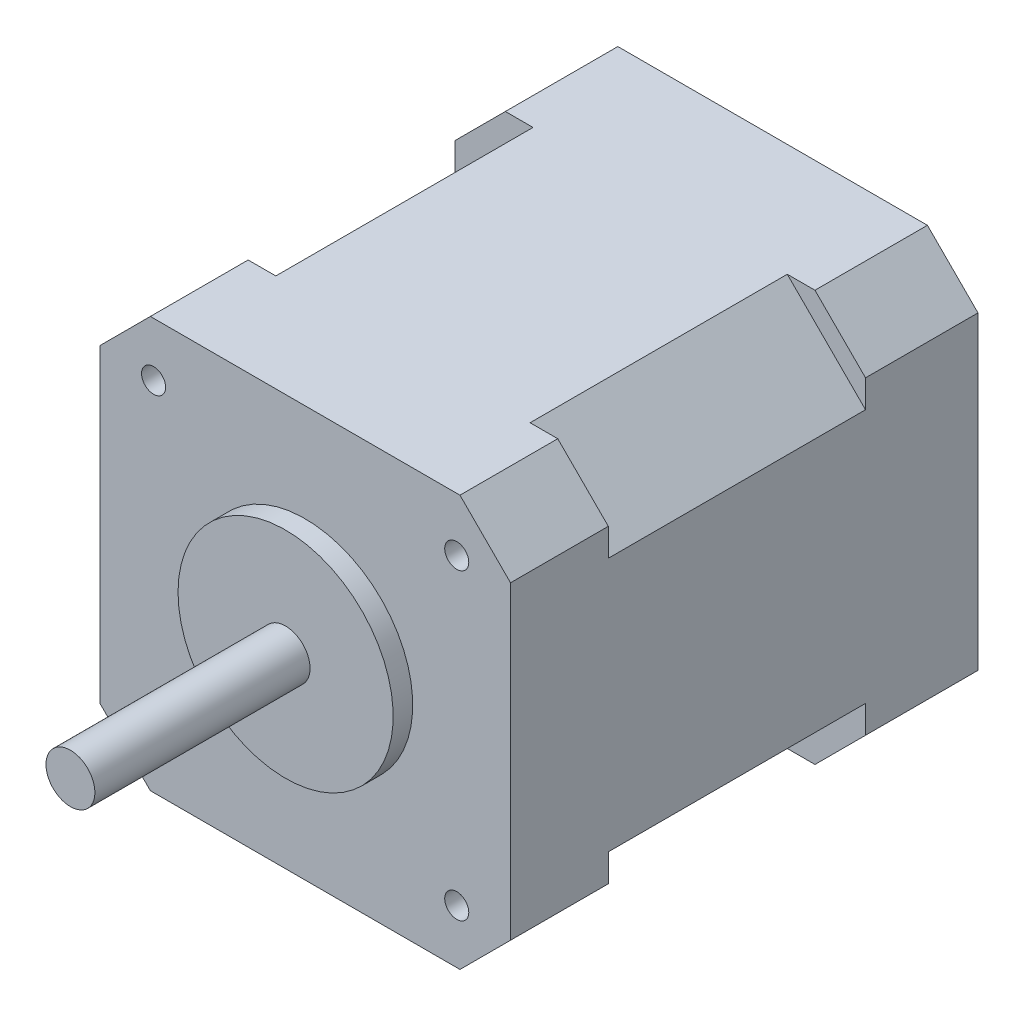
ISO-10303-21;
HEADER;
FILE_DESCRIPTION(('STEP AP214'),'2;1');
FILE_NAME('part.step','',(''),(''),'','','');
FILE_SCHEMA(('AUTOMOTIVE_DESIGN { 1 0 10303 214 1 1 1 1 }'));
ENDSEC;
DATA;
#1=APPLICATION_CONTEXT('core data for automotive mechanical design processes');
#2=APPLICATION_PROTOCOL_DEFINITION('international standard','automotive_design',2000,#1);
#3=PRODUCT_CONTEXT('',#1,'mechanical');
#4=PRODUCT('Part','Part','',(#3));
#5=PRODUCT_RELATED_PRODUCT_CATEGORY('part','',(#4));
#6=PRODUCT_DEFINITION_FORMATION('','',#4);
#7=PRODUCT_DEFINITION_CONTEXT('part definition',#1,'design');
#8=PRODUCT_DEFINITION('design','',#6,#7);
#9=PRODUCT_DEFINITION_SHAPE('','',#8);
#10=(LENGTH_UNIT() NAMED_UNIT(*) SI_UNIT(.MILLI.,.METRE.));
#11=(NAMED_UNIT(*) PLANE_ANGLE_UNIT() SI_UNIT($,.RADIAN.));
#12=(NAMED_UNIT(*) SI_UNIT($,.STERADIAN.) SOLID_ANGLE_UNIT());
#13=UNCERTAINTY_MEASURE_WITH_UNIT(LENGTH_MEASURE(1.E-05),#10,'distance_accuracy_value','');
#14=(GEOMETRIC_REPRESENTATION_CONTEXT(3) GLOBAL_UNCERTAINTY_ASSIGNED_CONTEXT((#13)) GLOBAL_UNIT_ASSIGNED_CONTEXT((#10,
#11,#12)) REPRESENTATION_CONTEXT('',''));
#15=CARTESIAN_POINT('',(0.,0.,0.));
#16=DIRECTION('',(0.,0.,1.));
#17=DIRECTION('',(1.,0.,0.));
#18=AXIS2_PLACEMENT_3D('',#15,#16,#17);
#19=CARTESIAN_POINT('',(21.,21.,11.5));
#20=DIRECTION('',(0.,0.,-1.));
#21=DIRECTION('',(-1.,0.,0.));
#22=AXIS2_PLACEMENT_3D('',#19,#20,#21);
#23=PLANE('',#22);
#24=DIRECTION('',(0.707106781186548,0.707106781186547,0.));
#25=VECTOR('',#24,1.);
#26=CARTESIAN_POINT('',(21.,-13.,11.5));
#27=LINE('',#26,#25);
#28=CARTESIAN_POINT('',(13.,-21.,11.5));
#29=VERTEX_POINT('',#28);
#30=CARTESIAN_POINT('',(21.,-13.,11.5));
#31=VERTEX_POINT('',#30);
#32=EDGE_CURVE('E219',#29,#31,#27,.T.);
#33=ORIENTED_EDGE('',*,*,#32,.F.);
#34=DIRECTION('',(-1.,0.,0.));
#35=VECTOR('',#34,1.);
#36=CARTESIAN_POINT('',(15.8284271247401,-21.,11.5));
#37=LINE('',#36,#35);
#38=CARTESIAN_POINT('',(15.8284271247401,-21.,11.5));
#39=VERTEX_POINT('',#38);
#40=EDGE_CURVE('E489',#39,#29,#37,.T.);
#41=ORIENTED_EDGE('',*,*,#40,.F.);
#42=DIRECTION('',(-0.707106781186547,-0.707106781186547,0.));
#43=VECTOR('',#42,1.);
#44=CARTESIAN_POINT('',(21.,-15.8284271247401,11.5));
#45=LINE('',#44,#43);
#46=CARTESIAN_POINT('',(21.,-15.8284271247401,11.5));
#47=VERTEX_POINT('',#46);
#48=EDGE_CURVE('E476',#47,#39,#45,.T.);
#49=ORIENTED_EDGE('',*,*,#48,.F.);
#50=DIRECTION('',(0.,-1.,0.));
#51=VECTOR('',#50,1.);
#52=CARTESIAN_POINT('',(21.,15.8284271247401,11.5));
#53=LINE('',#52,#51);
#54=EDGE_CURVE('E47',#31,#47,#53,.T.);
#55=ORIENTED_EDGE('',*,*,#54,.F.);
#56=EDGE_LOOP('',(#33,#41,#49,#55));
#57=FACE_BOUND('',#56,.T.);
#58=ADVANCED_FACE('F32',(#57),#23,.F.);
#59=DIRECTION('',(0.707106781186547,-0.707106781186548,0.));
#60=VECTOR('',#59,1.);
#61=CARTESIAN_POINT('',(-13.,-21.,11.5));
#62=LINE('',#61,#60);
#63=CARTESIAN_POINT('',(-21.,-13.,11.5));
#64=VERTEX_POINT('',#63);
#65=CARTESIAN_POINT('',(-13.,-21.,11.5));
#66=VERTEX_POINT('',#65);
#67=EDGE_CURVE('E343',#64,#66,#62,.T.);
#68=ORIENTED_EDGE('',*,*,#67,.F.);
#69=DIRECTION('',(0.,1.,0.));
#70=VECTOR('',#69,1.);
#71=CARTESIAN_POINT('',(-21.,-15.8284271247401,11.5));
#72=LINE('',#71,#70);
#73=CARTESIAN_POINT('',(-21.,-15.8284271247401,11.5));
#74=VERTEX_POINT('',#73);
#75=EDGE_CURVE('E403',#74,#64,#72,.T.);
#76=ORIENTED_EDGE('',*,*,#75,.F.);
#77=DIRECTION('',(-0.707106781186547,0.707106781186548,0.));
#78=VECTOR('',#77,1.);
#79=CARTESIAN_POINT('',(-15.8284271247401,-21.,11.5));
#80=LINE('',#79,#78);
#81=CARTESIAN_POINT('',(-15.8284271247401,-21.,11.5));
#82=VERTEX_POINT('',#81);
#83=EDGE_CURVE('E414',#82,#74,#80,.T.);
#84=ORIENTED_EDGE('',*,*,#83,.F.);
#85=EDGE_CURVE('E479',#66,#82,#37,.T.);
#86=ORIENTED_EDGE('',*,*,#85,.F.);
#87=EDGE_LOOP('',(#68,#76,#84,#86));
#88=FACE_BOUND('',#87,.T.);
#89=ADVANCED_FACE('F496',(#88),#23,.F.);
#90=DIRECTION('',(-0.707106781186548,-0.707106781186548,0.));
#91=VECTOR('',#90,1.);
#92=CARTESIAN_POINT('',(-21.,13.,11.5));
#93=LINE('',#92,#91);
#94=CARTESIAN_POINT('',(-13.,21.,11.5));
#95=VERTEX_POINT('',#94);
#96=CARTESIAN_POINT('',(-21.,13.,11.5));
#97=VERTEX_POINT('',#96);
#98=EDGE_CURVE('E348',#95,#97,#93,.T.);
#99=ORIENTED_EDGE('',*,*,#98,.F.);
#100=DIRECTION('',(1.,0.,0.));
#101=VECTOR('',#100,1.);
#102=CARTESIAN_POINT('',(-15.8284271247401,21.,11.5));
#103=LINE('',#102,#101);
#104=CARTESIAN_POINT('',(-15.8284271247401,21.,11.5));
#105=VERTEX_POINT('',#104);
#106=EDGE_CURVE('E464',#105,#95,#103,.T.);
#107=ORIENTED_EDGE('',*,*,#106,.F.);
#108=DIRECTION('',(0.707106781186547,0.707106781186548,0.));
#109=VECTOR('',#108,1.);
#110=CARTESIAN_POINT('',(-21.,15.8284271247401,11.5));
#111=LINE('',#110,#109);
#112=CARTESIAN_POINT('',(-21.,15.8284271247401,11.5));
#113=VERTEX_POINT('',#112);
#114=EDGE_CURVE('E408',#113,#105,#111,.T.);
#115=ORIENTED_EDGE('',*,*,#114,.F.);
#116=EDGE_CURVE('E409',#97,#113,#72,.T.);
#117=ORIENTED_EDGE('',*,*,#116,.F.);
#118=EDGE_LOOP('',(#99,#107,#115,#117));
#119=FACE_BOUND('',#118,.T.);
#120=ADVANCED_FACE('F498',(#119),#23,.F.);
#121=DIRECTION('',(-0.707106781186548,0.707106781186547,0.));
#122=VECTOR('',#121,1.);
#123=CARTESIAN_POINT('',(13.,21.,11.5));
#124=LINE('',#123,#122);
#125=CARTESIAN_POINT('',(21.,13.,11.5));
#126=VERTEX_POINT('',#125);
#127=CARTESIAN_POINT('',(13.,21.,11.5));
#128=VERTEX_POINT('',#127);
#129=EDGE_CURVE('E55',#126,#128,#124,.T.);
#130=ORIENTED_EDGE('',*,*,#129,.F.);
#131=CARTESIAN_POINT('',(21.,15.8284271247401,11.5));
#132=VERTEX_POINT('',#131);
#133=EDGE_CURVE('E475',#132,#126,#53,.T.);
#134=ORIENTED_EDGE('',*,*,#133,.F.);
#135=DIRECTION('',(0.707106781186547,-0.707106781186548,0.));
#136=VECTOR('',#135,1.);
#137=CARTESIAN_POINT('',(15.8284271247401,21.,11.5));
#138=LINE('',#137,#136);
#139=CARTESIAN_POINT('',(15.8284271247401,21.,11.5));
#140=VERTEX_POINT('',#139);
#141=EDGE_CURVE('E466',#140,#132,#138,.T.);
#142=ORIENTED_EDGE('',*,*,#141,.F.);
#143=EDGE_CURVE('E418',#128,#140,#103,.T.);
#144=ORIENTED_EDGE('',*,*,#143,.F.);
#145=EDGE_LOOP('',(#130,#134,#142,#144));
#146=FACE_BOUND('',#145,.T.);
#147=ADVANCED_FACE('F474',(#146),#23,.F.);
#148=CARTESIAN_POINT('',(-15.8284271247401,21.,11.5));
#149=DIRECTION('',(0.,1.,0.));
#150=DIRECTION('',(0.,0.,1.));
#151=AXIS2_PLACEMENT_3D('',#148,#149,#150);
#152=PLANE('',#151);
#153=DIRECTION('',(1.,0.,0.));
#154=VECTOR('',#153,1.);
#155=CARTESIAN_POINT('',(-15.8284271247401,21.,0.));
#156=LINE('',#155,#154);
#157=CARTESIAN_POINT('',(-15.8284271247401,21.,0.));
#158=VERTEX_POINT('',#157);
#159=CARTESIAN_POINT('',(15.8284271247401,21.,0.));
#160=VERTEX_POINT('',#159);
#161=EDGE_CURVE('E426',#158,#160,#156,.T.);
#162=ORIENTED_EDGE('',*,*,#161,.F.);
#163=DIRECTION('',(0.,0.,-1.));
#164=VECTOR('',#163,1.);
#165=CARTESIAN_POINT('',(-15.8284271247401,21.,11.5));
#166=LINE('',#165,#164);
#167=EDGE_CURVE('E451',#105,#158,#166,.T.);
#168=ORIENTED_EDGE('',*,*,#167,.F.);
#169=ORIENTED_EDGE('',*,*,#106,.T.);
#170=DIRECTION('',(0.,0.,-1.));
#171=VECTOR('',#170,1.);
#172=CARTESIAN_POINT('',(-13.,21.,37.8));
#173=LINE('',#172,#171);
#174=CARTESIAN_POINT('',(-13.,21.,37.8));
#175=VERTEX_POINT('',#174);
#176=EDGE_CURVE('E368',#175,#95,#173,.T.);
#177=ORIENTED_EDGE('',*,*,#176,.F.);
#178=DIRECTION('',(-1.,0.,0.));
#179=VECTOR('',#178,1.);
#180=CARTESIAN_POINT('',(-15.8284271247401,21.,37.8));
#181=LINE('',#180,#179);
#182=CARTESIAN_POINT('',(-15.8284271247401,21.,37.8));
#183=VERTEX_POINT('',#182);
#184=EDGE_CURVE('E217',#175,#183,#181,.T.);
#185=ORIENTED_EDGE('',*,*,#184,.T.);
#186=DIRECTION('',(0.,0.,-1.));
#187=VECTOR('',#186,1.);
#188=CARTESIAN_POINT('',(-15.8284271247401,21.,47.8));
#189=LINE('',#188,#187);
#190=CARTESIAN_POINT('',(-15.8284271247401,21.,47.8));
#191=VERTEX_POINT('',#190);
#192=EDGE_CURVE('E198',#191,#183,#189,.T.);
#193=ORIENTED_EDGE('',*,*,#192,.F.);
#194=DIRECTION('',(-1.,0.,0.));
#195=VECTOR('',#194,1.);
#196=CARTESIAN_POINT('',(-15.8284271247401,21.,47.8));
#197=LINE('',#196,#195);
#198=CARTESIAN_POINT('',(15.8284271247401,21.,47.8));
#199=VERTEX_POINT('',#198);
#200=EDGE_CURVE('E204',#199,#191,#197,.T.);
#201=ORIENTED_EDGE('',*,*,#200,.F.);
#202=DIRECTION('',(0.,0.,-1.));
#203=VECTOR('',#202,1.);
#204=CARTESIAN_POINT('',(15.8284271247401,21.,47.8));
#205=LINE('',#204,#203);
#206=CARTESIAN_POINT('',(15.8284271247401,21.,37.8));
#207=VERTEX_POINT('',#206);
#208=EDGE_CURVE('E286',#199,#207,#205,.T.);
#209=ORIENTED_EDGE('',*,*,#208,.T.);
#210=CARTESIAN_POINT('',(13.,21.,37.8));
#211=VERTEX_POINT('',#210);
#212=EDGE_CURVE('E227',#207,#211,#181,.T.);
#213=ORIENTED_EDGE('',*,*,#212,.T.);
#214=DIRECTION('',(0.,0.,-1.));
#215=VECTOR('',#214,1.);
#216=CARTESIAN_POINT('',(13.,21.,37.8));
#217=LINE('',#216,#215);
#218=EDGE_CURVE('E292',#211,#128,#217,.T.);
#219=ORIENTED_EDGE('',*,*,#218,.T.);
#220=ORIENTED_EDGE('',*,*,#143,.T.);
#221=DIRECTION('',(0.,0.,-1.));
#222=VECTOR('',#221,1.);
#223=CARTESIAN_POINT('',(15.8284271247401,21.,11.5));
#224=LINE('',#223,#222);
#225=EDGE_CURVE('E412',#140,#160,#224,.T.);
#226=ORIENTED_EDGE('',*,*,#225,.T.);
#227=EDGE_LOOP('',(#162,#168,#169,#177,#185,#193,#201,#209,#213,#219,#220,#226));
#228=FACE_BOUND('',#227,.T.);
#229=ADVANCED_FACE('F34',(#228),#152,.T.);
#230=CARTESIAN_POINT('',(-21.,15.8284271247401,11.5));
#231=DIRECTION('',(-0.707106781186548,0.707106781186547,0.));
#232=DIRECTION('',(-0.707106781186547,-0.707106781186548,0.));
#233=AXIS2_PLACEMENT_3D('',#230,#231,#232);
#234=PLANE('',#233);
#235=DIRECTION('',(0.707106781186547,0.707106781186548,0.));
#236=VECTOR('',#235,1.);
#237=CARTESIAN_POINT('',(-21.,15.8284271247401,0.));
#238=LINE('',#237,#236);
#239=CARTESIAN_POINT('',(-21.,15.8284271247401,0.));
#240=VERTEX_POINT('',#239);
#241=EDGE_CURVE('E448',#240,#158,#238,.T.);
#242=ORIENTED_EDGE('',*,*,#241,.F.);
#243=DIRECTION('',(0.,0.,-1.));
#244=VECTOR('',#243,1.);
#245=CARTESIAN_POINT('',(-21.,15.8284271247401,11.5));
#246=LINE('',#245,#244);
#247=EDGE_CURVE('E453',#113,#240,#246,.T.);
#248=ORIENTED_EDGE('',*,*,#247,.F.);
#249=ORIENTED_EDGE('',*,*,#114,.T.);
#250=ORIENTED_EDGE('',*,*,#167,.T.);
#251=EDGE_LOOP('',(#242,#248,#249,#250));
#252=FACE_BOUND('',#251,.T.);
#253=ADVANCED_FACE('F513',(#252),#234,.T.);
#254=CARTESIAN_POINT('',(-21.,-15.8284271247401,11.5));
#255=DIRECTION('',(-1.,0.,0.));
#256=DIRECTION('',(0.,-1.,0.));
#257=AXIS2_PLACEMENT_3D('',#254,#255,#256);
#258=PLANE('',#257);
#259=CARTESIAN_POINT('',(-21.,0.649999999999998,4.95));
#260=DIRECTION('',(-1.,0.,0.));
#261=DIRECTION('',(0.,-1.,0.));
#262=AXIS2_PLACEMENT_3D('',#259,#260,#261);
#263=CIRCLE('',#262,0.6);
#264=CARTESIAN_POINT('',(-21.,0.049999999999998,4.95));
#265=VERTEX_POINT('',#264);
#266=EDGE_CURVE('E11',#265,#265,#263,.T.);
#267=ORIENTED_EDGE('',*,*,#266,.F.);
#268=EDGE_LOOP('',(#267));
#269=FACE_BOUND('',#268,.T.);
#270=CARTESIAN_POINT('',(-21.,-0.650000000000001,4.95));
#271=DIRECTION('',(-1.,0.,0.));
#272=DIRECTION('',(0.,-1.,0.));
#273=AXIS2_PLACEMENT_3D('',#270,#271,#272);
#274=CIRCLE('',#273,0.6);
#275=CARTESIAN_POINT('',(-21.,-1.25,4.95));
#276=VERTEX_POINT('',#275);
#277=EDGE_CURVE('E40',#276,#276,#274,.T.);
#278=ORIENTED_EDGE('',*,*,#277,.F.);
#279=EDGE_LOOP('',(#278));
#280=FACE_BOUND('',#279,.T.);
#281=CARTESIAN_POINT('',(-21.,-0.650000000000001,3.65));
#282=DIRECTION('',(-1.,0.,0.));
#283=DIRECTION('',(0.,-1.,0.));
#284=AXIS2_PLACEMENT_3D('',#281,#282,#283);
#285=CIRCLE('',#284,0.6);
#286=CARTESIAN_POINT('',(-21.,-1.25,3.65));
#287=VERTEX_POINT('',#286);
#288=EDGE_CURVE('E1012',#287,#287,#285,.T.);
#289=ORIENTED_EDGE('',*,*,#288,.F.);
#290=EDGE_LOOP('',(#289));
#291=FACE_BOUND('',#290,.T.);
#292=CARTESIAN_POINT('',(-21.,0.649999999999998,3.65));
#293=DIRECTION('',(-1.,0.,0.));
#294=DIRECTION('',(0.,-1.,0.));
#295=AXIS2_PLACEMENT_3D('',#292,#293,#294);
#296=CIRCLE('',#295,0.6);
#297=CARTESIAN_POINT('',(-21.,0.049999999999998,3.65));
#298=VERTEX_POINT('',#297);
#299=EDGE_CURVE('E353',#298,#298,#296,.T.);
#300=ORIENTED_EDGE('',*,*,#299,.F.);
#301=EDGE_LOOP('',(#300));
#302=FACE_BOUND('',#301,.T.);
#303=DIRECTION('',(0.,1.,0.));
#304=VECTOR('',#303,1.);
#305=CARTESIAN_POINT('',(-21.,-15.8284271247401,0.));
#306=LINE('',#305,#304);
#307=CARTESIAN_POINT('',(-21.,-15.8284271247401,0.));
#308=VERTEX_POINT('',#307);
#309=EDGE_CURVE('E445',#308,#240,#306,.T.);
#310=ORIENTED_EDGE('',*,*,#309,.F.);
#311=DIRECTION('',(0.,0.,-1.));
#312=VECTOR('',#311,1.);
#313=CARTESIAN_POINT('',(-21.,-15.8284271247401,11.5));
#314=LINE('',#313,#312);
#315=EDGE_CURVE('E404',#74,#308,#314,.T.);
#316=ORIENTED_EDGE('',*,*,#315,.F.);
#317=ORIENTED_EDGE('',*,*,#75,.T.);
#318=DIRECTION('',(0.,0.,-1.));
#319=VECTOR('',#318,1.);
#320=CARTESIAN_POINT('',(-21.,-13.,37.8));
#321=LINE('',#320,#319);
#322=CARTESIAN_POINT('',(-21.,-13.,37.8));
#323=VERTEX_POINT('',#322);
#324=EDGE_CURVE('E376',#323,#64,#321,.T.);
#325=ORIENTED_EDGE('',*,*,#324,.F.);
#326=DIRECTION('',(0.,-1.,0.));
#327=VECTOR('',#326,1.);
#328=CARTESIAN_POINT('',(-21.,-15.8284271247401,37.8));
#329=LINE('',#328,#327);
#330=CARTESIAN_POINT('',(-21.,-15.8284271247401,37.8));
#331=VERTEX_POINT('',#330);
#332=EDGE_CURVE('E239',#323,#331,#329,.T.);
#333=ORIENTED_EDGE('',*,*,#332,.T.);
#334=DIRECTION('',(0.,0.,-1.));
#335=VECTOR('',#334,1.);
#336=CARTESIAN_POINT('',(-21.,-15.8284271247401,47.8));
#337=LINE('',#336,#335);
#338=CARTESIAN_POINT('',(-21.,-15.8284271247401,47.8));
#339=VERTEX_POINT('',#338);
#340=EDGE_CURVE('E223',#339,#331,#337,.T.);
#341=ORIENTED_EDGE('',*,*,#340,.F.);
#342=DIRECTION('',(0.,-1.,0.));
#343=VECTOR('',#342,1.);
#344=CARTESIAN_POINT('',(-21.,-15.8284271247401,47.8));
#345=LINE('',#344,#343);
#346=CARTESIAN_POINT('',(-21.,15.8284271247401,47.8));
#347=VERTEX_POINT('',#346);
#348=EDGE_CURVE('E203',#347,#339,#345,.T.);
#349=ORIENTED_EDGE('',*,*,#348,.F.);
#350=DIRECTION('',(0.,0.,-1.));
#351=VECTOR('',#350,1.);
#352=CARTESIAN_POINT('',(-21.,15.8284271247401,47.8));
#353=LINE('',#352,#351);
#354=CARTESIAN_POINT('',(-21.,15.8284271247401,37.8));
#355=VERTEX_POINT('',#354);
#356=EDGE_CURVE('E200',#347,#355,#353,.T.);
#357=ORIENTED_EDGE('',*,*,#356,.T.);
#358=CARTESIAN_POINT('',(-21.,13.,37.8));
#359=VERTEX_POINT('',#358);
#360=EDGE_CURVE('E248',#355,#359,#329,.T.);
#361=ORIENTED_EDGE('',*,*,#360,.T.);
#362=DIRECTION('',(0.,0.,-1.));
#363=VECTOR('',#362,1.);
#364=CARTESIAN_POINT('',(-21.,13.,37.8));
#365=LINE('',#364,#363);
#366=EDGE_CURVE('E371',#359,#97,#365,.T.);
#367=ORIENTED_EDGE('',*,*,#366,.T.);
#368=ORIENTED_EDGE('',*,*,#116,.T.);
#369=ORIENTED_EDGE('',*,*,#247,.T.);
#370=EDGE_LOOP('',(#310,#316,#317,#325,#333,#341,#349,#357,#361,#367,#368,#369));
#371=FACE_BOUND('',#370,.T.);
#372=ADVANCED_FACE('F401',(#269,#280,#291,#302,#371),#258,.T.);
#373=CARTESIAN_POINT('',(-15.8284271247401,-21.,11.5));
#374=DIRECTION('',(-0.707106781186548,-0.707106781186547,0.));
#375=DIRECTION('',(0.707106781186547,-0.707106781186548,0.));
#376=AXIS2_PLACEMENT_3D('',#373,#374,#375);
#377=PLANE('',#376);
#378=DIRECTION('',(-0.707106781186547,0.707106781186548,0.));
#379=VECTOR('',#378,1.);
#380=CARTESIAN_POINT('',(-15.8284271247401,-21.,0.));
#381=LINE('',#380,#379);
#382=CARTESIAN_POINT('',(-15.8284271247401,-21.,0.));
#383=VERTEX_POINT('',#382);
#384=EDGE_CURVE('E442',#383,#308,#381,.T.);
#385=ORIENTED_EDGE('',*,*,#384,.F.);
#386=DIRECTION('',(0.,0.,-1.));
#387=VECTOR('',#386,1.);
#388=CARTESIAN_POINT('',(-15.8284271247401,-21.,11.5));
#389=LINE('',#388,#387);
#390=EDGE_CURVE('E456',#82,#383,#389,.T.);
#391=ORIENTED_EDGE('',*,*,#390,.F.);
#392=ORIENTED_EDGE('',*,*,#83,.T.);
#393=ORIENTED_EDGE('',*,*,#315,.T.);
#394=EDGE_LOOP('',(#385,#391,#392,#393));
#395=FACE_BOUND('',#394,.T.);
#396=ADVANCED_FACE('F495',(#395),#377,.T.);
#397=CARTESIAN_POINT('',(15.8284271247401,-21.,11.5));
#398=DIRECTION('',(0.,-1.,0.));
#399=DIRECTION('',(1.,0.,0.));
#400=AXIS2_PLACEMENT_3D('',#397,#398,#399);
#401=PLANE('',#400);
#402=DIRECTION('',(-1.,0.,0.));
#403=VECTOR('',#402,1.);
#404=CARTESIAN_POINT('',(15.8284271247401,-21.,0.));
#405=LINE('',#404,#403);
#406=CARTESIAN_POINT('',(15.8284271247401,-21.,0.));
#407=VERTEX_POINT('',#406);
#408=EDGE_CURVE('E439',#407,#383,#405,.T.);
#409=ORIENTED_EDGE('',*,*,#408,.F.);
#410=DIRECTION('',(0.,0.,-1.));
#411=VECTOR('',#410,1.);
#412=CARTESIAN_POINT('',(15.8284271247401,-21.,11.5));
#413=LINE('',#412,#411);
#414=EDGE_CURVE('E458',#39,#407,#413,.T.);
#415=ORIENTED_EDGE('',*,*,#414,.F.);
#416=ORIENTED_EDGE('',*,*,#40,.T.);
#417=DIRECTION('',(0.,0.,-1.));
#418=VECTOR('',#417,1.);
#419=CARTESIAN_POINT('',(13.,-21.,37.8));
#420=LINE('',#419,#418);
#421=CARTESIAN_POINT('',(13.,-21.,37.8));
#422=VERTEX_POINT('',#421);
#423=EDGE_CURVE('E365',#422,#29,#420,.T.);
#424=ORIENTED_EDGE('',*,*,#423,.F.);
#425=DIRECTION('',(1.,0.,0.));
#426=VECTOR('',#425,1.);
#427=CARTESIAN_POINT('',(15.8284271247401,-21.,37.8));
#428=LINE('',#427,#426);
#429=CARTESIAN_POINT('',(15.8284271247401,-21.,37.8));
#430=VERTEX_POINT('',#429);
#431=EDGE_CURVE('E251',#422,#430,#428,.T.);
#432=ORIENTED_EDGE('',*,*,#431,.T.);
#433=DIRECTION('',(0.,0.,-1.));
#434=VECTOR('',#433,1.);
#435=CARTESIAN_POINT('',(15.8284271247401,-21.,47.8));
#436=LINE('',#435,#434);
#437=CARTESIAN_POINT('',(15.8284271247401,-21.,47.8));
#438=VERTEX_POINT('',#437);
#439=EDGE_CURVE('E296',#438,#430,#436,.T.);
#440=ORIENTED_EDGE('',*,*,#439,.F.);
#441=DIRECTION('',(1.,0.,0.));
#442=VECTOR('',#441,1.);
#443=CARTESIAN_POINT('',(15.8284271247401,-21.,47.8));
#444=LINE('',#443,#442);
#445=CARTESIAN_POINT('',(-15.8284271247401,-21.,47.8));
#446=VERTEX_POINT('',#445);
#447=EDGE_CURVE('E325',#446,#438,#444,.T.);
#448=ORIENTED_EDGE('',*,*,#447,.F.);
#449=DIRECTION('',(0.,0.,-1.));
#450=VECTOR('',#449,1.);
#451=CARTESIAN_POINT('',(-15.8284271247401,-21.,47.8));
#452=LINE('',#451,#450);
#453=CARTESIAN_POINT('',(-15.8284271247401,-21.,37.8));
#454=VERTEX_POINT('',#453);
#455=EDGE_CURVE('E299',#446,#454,#452,.T.);
#456=ORIENTED_EDGE('',*,*,#455,.T.);
#457=CARTESIAN_POINT('',(-13.,-21.,37.8));
#458=VERTEX_POINT('',#457);
#459=EDGE_CURVE('E253',#454,#458,#428,.T.);
#460=ORIENTED_EDGE('',*,*,#459,.T.);
#461=DIRECTION('',(0.,0.,-1.));
#462=VECTOR('',#461,1.);
#463=CARTESIAN_POINT('',(-13.,-21.,37.8));
#464=LINE('',#463,#462);
#465=EDGE_CURVE('E322',#458,#66,#464,.T.);
#466=ORIENTED_EDGE('',*,*,#465,.T.);
#467=ORIENTED_EDGE('',*,*,#85,.T.);
#468=ORIENTED_EDGE('',*,*,#390,.T.);
#469=EDGE_LOOP('',(#409,#415,#416,#424,#432,#440,#448,#456,#460,#466,#467,#468));
#470=FACE_BOUND('',#469,.T.);
#471=ADVANCED_FACE('F321',(#470),#401,.T.);
#472=CARTESIAN_POINT('',(21.,-15.8284271247401,11.5));
#473=DIRECTION('',(0.707106781186548,-0.707106781186548,0.));
#474=DIRECTION('',(0.707106781186548,0.707106781186548,0.));
#475=AXIS2_PLACEMENT_3D('',#472,#473,#474);
#476=PLANE('',#475);
#477=DIRECTION('',(-0.707106781186547,-0.707106781186547,0.));
#478=VECTOR('',#477,1.);
#479=CARTESIAN_POINT('',(21.,-15.8284271247401,0.));
#480=LINE('',#479,#478);
#481=CARTESIAN_POINT('',(21.,-15.8284271247401,0.));
#482=VERTEX_POINT('',#481);
#483=EDGE_CURVE('E436',#482,#407,#480,.T.);
#484=ORIENTED_EDGE('',*,*,#483,.F.);
#485=DIRECTION('',(0.,0.,-1.));
#486=VECTOR('',#485,1.);
#487=CARTESIAN_POINT('',(21.,-15.8284271247401,11.5));
#488=LINE('',#487,#486);
#489=EDGE_CURVE('E460',#47,#482,#488,.T.);
#490=ORIENTED_EDGE('',*,*,#489,.F.);
#491=ORIENTED_EDGE('',*,*,#48,.T.);
#492=ORIENTED_EDGE('',*,*,#414,.T.);
#493=EDGE_LOOP('',(#484,#490,#491,#492));
#494=FACE_BOUND('',#493,.T.);
#495=ADVANCED_FACE('F524',(#494),#476,.T.);
#496=CARTESIAN_POINT('',(21.,15.8284271247401,11.5));
#497=DIRECTION('',(1.,0.,0.));
#498=DIRECTION('',(0.,0.,-1.));
#499=AXIS2_PLACEMENT_3D('',#496,#497,#498);
#500=PLANE('',#499);
#501=DIRECTION('',(0.,-1.,0.));
#502=VECTOR('',#501,1.);
#503=CARTESIAN_POINT('',(21.,15.8284271247401,0.));
#504=LINE('',#503,#502);
#505=CARTESIAN_POINT('',(21.,15.8284271247401,0.));
#506=VERTEX_POINT('',#505);
#507=EDGE_CURVE('E433',#506,#482,#504,.T.);
#508=ORIENTED_EDGE('',*,*,#507,.F.);
#509=DIRECTION('',(0.,0.,-1.));
#510=VECTOR('',#509,1.);
#511=CARTESIAN_POINT('',(21.,15.8284271247401,11.5));
#512=LINE('',#511,#510);
#513=EDGE_CURVE('E462',#132,#506,#512,.T.);
#514=ORIENTED_EDGE('',*,*,#513,.F.);
#515=ORIENTED_EDGE('',*,*,#133,.T.);
#516=DIRECTION('',(0.,0.,-1.));
#517=VECTOR('',#516,1.);
#518=CARTESIAN_POINT('',(21.,13.,37.8));
#519=LINE('',#518,#517);
#520=CARTESIAN_POINT('',(21.,13.,37.8));
#521=VERTEX_POINT('',#520);
#522=EDGE_CURVE('E278',#521,#126,#519,.T.);
#523=ORIENTED_EDGE('',*,*,#522,.F.);
#524=DIRECTION('',(0.,1.,0.));
#525=VECTOR('',#524,1.);
#526=CARTESIAN_POINT('',(21.,15.8284271247401,37.8));
#527=LINE('',#526,#525);
#528=CARTESIAN_POINT('',(21.,15.8284271247401,37.8));
#529=VERTEX_POINT('',#528);
#530=EDGE_CURVE('E260',#521,#529,#527,.T.);
#531=ORIENTED_EDGE('',*,*,#530,.T.);
#532=DIRECTION('',(0.,0.,-1.));
#533=VECTOR('',#532,1.);
#534=CARTESIAN_POINT('',(21.,15.8284271247401,47.8));
#535=LINE('',#534,#533);
#536=CARTESIAN_POINT('',(21.,15.8284271247401,47.8));
#537=VERTEX_POINT('',#536);
#538=EDGE_CURVE('E276',#537,#529,#535,.T.);
#539=ORIENTED_EDGE('',*,*,#538,.F.);
#540=DIRECTION('',(0.,1.,0.));
#541=VECTOR('',#540,1.);
#542=CARTESIAN_POINT('',(21.,15.8284271247401,47.8));
#543=LINE('',#542,#541);
#544=CARTESIAN_POINT('',(21.,-15.8284271247401,47.8));
#545=VERTEX_POINT('',#544);
#546=EDGE_CURVE('E293',#545,#537,#543,.T.);
#547=ORIENTED_EDGE('',*,*,#546,.F.);
#548=DIRECTION('',(0.,0.,-1.));
#549=VECTOR('',#548,1.);
#550=CARTESIAN_POINT('',(21.,-15.8284271247401,47.8));
#551=LINE('',#550,#549);
#552=CARTESIAN_POINT('',(21.,-15.8284271247401,37.8));
#553=VERTEX_POINT('',#552);
#554=EDGE_CURVE('E285',#545,#553,#551,.T.);
#555=ORIENTED_EDGE('',*,*,#554,.T.);
#556=CARTESIAN_POINT('',(21.,-13.,37.8));
#557=VERTEX_POINT('',#556);
#558=EDGE_CURVE('E265',#553,#557,#527,.T.);
#559=ORIENTED_EDGE('',*,*,#558,.T.);
#560=DIRECTION('',(0.,0.,-1.));
#561=VECTOR('',#560,1.);
#562=CARTESIAN_POINT('',(21.,-13.,37.8));
#563=LINE('',#562,#561);
#564=EDGE_CURVE('E430',#557,#31,#563,.T.);
#565=ORIENTED_EDGE('',*,*,#564,.T.);
#566=ORIENTED_EDGE('',*,*,#54,.T.);
#567=ORIENTED_EDGE('',*,*,#489,.T.);
#568=EDGE_LOOP('',(#508,#514,#515,#523,#531,#539,#547,#555,#559,#565,#566,#567));
#569=FACE_BOUND('',#568,.T.);
#570=ADVANCED_FACE('F274',(#569),#500,.T.);
#571=CARTESIAN_POINT('',(15.8284271247401,21.,11.5));
#572=DIRECTION('',(0.707106781186548,0.707106781186547,0.));
#573=DIRECTION('',(-0.707106781186547,0.707106781186548,0.));
#574=AXIS2_PLACEMENT_3D('',#571,#572,#573);
#575=PLANE('',#574);
#576=DIRECTION('',(0.707106781186547,-0.707106781186548,0.));
#577=VECTOR('',#576,1.);
#578=CARTESIAN_POINT('',(15.8284271247401,21.,0.));
#579=LINE('',#578,#577);
#580=EDGE_CURVE('E429',#160,#506,#579,.T.);
#581=ORIENTED_EDGE('',*,*,#580,.F.);
#582=ORIENTED_EDGE('',*,*,#225,.F.);
#583=ORIENTED_EDGE('',*,*,#141,.T.);
#584=ORIENTED_EDGE('',*,*,#513,.T.);
#585=EDGE_LOOP('',(#581,#582,#583,#584));
#586=FACE_BOUND('',#585,.T.);
#587=ADVANCED_FACE('F473',(#586),#575,.T.);
#588=CARTESIAN_POINT('',(21.,21.,0.));
#589=DIRECTION('',(0.,0.,-1.));
#590=DIRECTION('',(-1.,0.,0.));
#591=AXIS2_PLACEMENT_3D('',#588,#589,#590);
#592=PLANE('',#591);
#593=ORIENTED_EDGE('',*,*,#161,.T.);
#594=ORIENTED_EDGE('',*,*,#580,.T.);
#595=ORIENTED_EDGE('',*,*,#507,.T.);
#596=ORIENTED_EDGE('',*,*,#483,.T.);
#597=ORIENTED_EDGE('',*,*,#408,.T.);
#598=ORIENTED_EDGE('',*,*,#384,.T.);
#599=ORIENTED_EDGE('',*,*,#309,.T.);
#600=ORIENTED_EDGE('',*,*,#241,.T.);
#601=EDGE_LOOP('',(#593,#594,#595,#596,#597,#598,#599,#600));
#602=FACE_BOUND('',#601,.T.);
#603=ADVANCED_FACE('F509',(#602),#592,.T.);
#604=CARTESIAN_POINT('',(21.,-13.,37.8));
#605=DIRECTION('',(-0.707106781186547,0.707106781186548,0.));
#606=DIRECTION('',(-0.707106781186548,-0.707106781186547,0.));
#607=AXIS2_PLACEMENT_3D('',#604,#605,#606);
#608=PLANE('',#607);
#609=ORIENTED_EDGE('',*,*,#32,.T.);
#610=ORIENTED_EDGE('',*,*,#564,.F.);
#611=DIRECTION('',(0.707106781186548,0.707106781186547,0.));
#612=VECTOR('',#611,1.);
#613=CARTESIAN_POINT('',(21.,-13.,37.8));
#614=LINE('',#613,#612);
#615=EDGE_CURVE('E340',#422,#557,#614,.T.);
#616=ORIENTED_EDGE('',*,*,#615,.F.);
#617=ORIENTED_EDGE('',*,*,#423,.T.);
#618=EDGE_LOOP('',(#609,#610,#616,#617));
#619=FACE_BOUND('',#618,.T.);
#620=ADVANCED_FACE('F507',(#619),#608,.F.);
#621=CARTESIAN_POINT('',(13.,21.,37.8));
#622=DIRECTION('',(-0.707106781186547,-0.707106781186548,0.));
#623=DIRECTION('',(0.707106781186548,-0.707106781186547,0.));
#624=AXIS2_PLACEMENT_3D('',#621,#622,#623);
#625=PLANE('',#624);
#626=ORIENTED_EDGE('',*,*,#129,.T.);
#627=ORIENTED_EDGE('',*,*,#218,.F.);
#628=DIRECTION('',(-0.707106781186548,0.707106781186547,0.));
#629=VECTOR('',#628,1.);
#630=CARTESIAN_POINT('',(13.,21.,37.8));
#631=LINE('',#630,#629);
#632=EDGE_CURVE('E290',#521,#211,#631,.T.);
#633=ORIENTED_EDGE('',*,*,#632,.F.);
#634=ORIENTED_EDGE('',*,*,#522,.T.);
#635=EDGE_LOOP('',(#626,#627,#633,#634));
#636=FACE_BOUND('',#635,.T.);
#637=ADVANCED_FACE('F546',(#636),#625,.F.);
#638=CARTESIAN_POINT('',(-21.,13.,37.8));
#639=DIRECTION('',(0.707106781186547,-0.707106781186547,0.));
#640=DIRECTION('',(0.707106781186548,0.707106781186548,0.));
#641=AXIS2_PLACEMENT_3D('',#638,#639,#640);
#642=PLANE('',#641);
#643=ORIENTED_EDGE('',*,*,#98,.T.);
#644=ORIENTED_EDGE('',*,*,#366,.F.);
#645=DIRECTION('',(-0.707106781186548,-0.707106781186548,0.));
#646=VECTOR('',#645,1.);
#647=CARTESIAN_POINT('',(-21.,13.,37.8));
#648=LINE('',#647,#646);
#649=EDGE_CURVE('E345',#175,#359,#648,.T.);
#650=ORIENTED_EDGE('',*,*,#649,.F.);
#651=ORIENTED_EDGE('',*,*,#176,.T.);
#652=EDGE_LOOP('',(#643,#644,#650,#651));
#653=FACE_BOUND('',#652,.T.);
#654=ADVANCED_FACE('F552',(#653),#642,.F.);
#655=CARTESIAN_POINT('',(-13.,-21.,37.8));
#656=DIRECTION('',(0.707106781186548,0.707106781186547,0.));
#657=DIRECTION('',(-0.707106781186547,0.707106781186548,0.));
#658=AXIS2_PLACEMENT_3D('',#655,#656,#657);
#659=PLANE('',#658);
#660=ORIENTED_EDGE('',*,*,#67,.T.);
#661=ORIENTED_EDGE('',*,*,#465,.F.);
#662=DIRECTION('',(0.707106781186547,-0.707106781186548,0.));
#663=VECTOR('',#662,1.);
#664=CARTESIAN_POINT('',(-13.,-21.,37.8));
#665=LINE('',#664,#663);
#666=EDGE_CURVE('E317',#323,#458,#665,.T.);
#667=ORIENTED_EDGE('',*,*,#666,.F.);
#668=ORIENTED_EDGE('',*,*,#324,.T.);
#669=EDGE_LOOP('',(#660,#661,#667,#668));
#670=FACE_BOUND('',#669,.T.);
#671=ADVANCED_FACE('F398',(#670),#659,.F.);
#672=CARTESIAN_POINT('',(21.,21.,37.8));
#673=DIRECTION('',(0.,0.,-1.));
#674=DIRECTION('',(-1.,0.,0.));
#675=AXIS2_PLACEMENT_3D('',#672,#673,#674);
#676=PLANE('',#675);
#677=ORIENTED_EDGE('',*,*,#431,.F.);
#678=ORIENTED_EDGE('',*,*,#615,.T.);
#679=ORIENTED_EDGE('',*,*,#558,.F.);
#680=DIRECTION('',(0.707106781186548,0.707106781186547,0.));
#681=VECTOR('',#680,1.);
#682=CARTESIAN_POINT('',(21.,-15.8284271247401,37.8));
#683=LINE('',#682,#681);
#684=EDGE_CURVE('E257',#430,#553,#683,.T.);
#685=ORIENTED_EDGE('',*,*,#684,.F.);
#686=EDGE_LOOP('',(#677,#678,#679,#685));
#687=FACE_BOUND('',#686,.T.);
#688=ADVANCED_FACE('F338',(#687),#676,.T.);
#689=ORIENTED_EDGE('',*,*,#530,.F.);
#690=ORIENTED_EDGE('',*,*,#632,.T.);
#691=ORIENTED_EDGE('',*,*,#212,.F.);
#692=DIRECTION('',(-0.707106781186547,0.707106781186548,0.));
#693=VECTOR('',#692,1.);
#694=CARTESIAN_POINT('',(15.8284271247401,21.,37.8));
#695=LINE('',#694,#693);
#696=EDGE_CURVE('E213',#529,#207,#695,.T.);
#697=ORIENTED_EDGE('',*,*,#696,.F.);
#698=EDGE_LOOP('',(#689,#690,#691,#697));
#699=FACE_BOUND('',#698,.T.);
#700=ADVANCED_FACE('F289',(#699),#676,.T.);
#701=ORIENTED_EDGE('',*,*,#184,.F.);
#702=ORIENTED_EDGE('',*,*,#649,.T.);
#703=ORIENTED_EDGE('',*,*,#360,.F.);
#704=DIRECTION('',(-0.707106781186547,-0.707106781186547,0.));
#705=VECTOR('',#704,1.);
#706=CARTESIAN_POINT('',(-21.,15.8284271247401,37.8));
#707=LINE('',#706,#705);
#708=EDGE_CURVE('E231',#183,#355,#707,.T.);
#709=ORIENTED_EDGE('',*,*,#708,.F.);
#710=EDGE_LOOP('',(#701,#702,#703,#709));
#711=FACE_BOUND('',#710,.T.);
#712=ADVANCED_FACE('F578',(#711),#676,.T.);
#713=CARTESIAN_POINT('',(-21.,15.8284271247401,47.8));
#714=DIRECTION('',(0.707106781186548,-0.707106781186548,0.));
#715=DIRECTION('',(0.707106781186548,0.707106781186548,0.));
#716=AXIS2_PLACEMENT_3D('',#713,#714,#715);
#717=PLANE('',#716);
#718=ORIENTED_EDGE('',*,*,#708,.T.);
#719=ORIENTED_EDGE('',*,*,#356,.F.);
#720=DIRECTION('',(-0.707106781186547,-0.707106781186547,0.));
#721=VECTOR('',#720,1.);
#722=CARTESIAN_POINT('',(-21.,15.8284271247401,47.8));
#723=LINE('',#722,#721);
#724=EDGE_CURVE('E194',#191,#347,#723,.T.);
#725=ORIENTED_EDGE('',*,*,#724,.F.);
#726=ORIENTED_EDGE('',*,*,#192,.T.);
#727=EDGE_LOOP('',(#718,#719,#725,#726));
#728=FACE_BOUND('',#727,.T.);
#729=ADVANCED_FACE('F196',(#728),#717,.F.);
#730=CARTESIAN_POINT('',(-15.8284271247401,-21.,47.8));
#731=DIRECTION('',(0.707106781186548,0.707106781186547,0.));
#732=DIRECTION('',(-0.707106781186547,0.707106781186548,0.));
#733=AXIS2_PLACEMENT_3D('',#730,#731,#732);
#734=PLANE('',#733);
#735=DIRECTION('',(0.707106781186547,-0.707106781186548,0.));
#736=VECTOR('',#735,1.);
#737=CARTESIAN_POINT('',(-15.8284271247401,-21.,37.8));
#738=LINE('',#737,#736);
#739=EDGE_CURVE('E242',#331,#454,#738,.T.);
#740=ORIENTED_EDGE('',*,*,#739,.T.);
#741=ORIENTED_EDGE('',*,*,#455,.F.);
#742=DIRECTION('',(0.707106781186547,-0.707106781186548,0.));
#743=VECTOR('',#742,1.);
#744=CARTESIAN_POINT('',(-15.8284271247401,-21.,47.8));
#745=LINE('',#744,#743);
#746=EDGE_CURVE('E308',#339,#446,#745,.T.);
#747=ORIENTED_EDGE('',*,*,#746,.F.);
#748=ORIENTED_EDGE('',*,*,#340,.T.);
#749=EDGE_LOOP('',(#740,#741,#747,#748));
#750=FACE_BOUND('',#749,.T.);
#751=ADVANCED_FACE('F306',(#750),#734,.F.);
#752=CARTESIAN_POINT('',(21.,-15.8284271247401,47.8));
#753=DIRECTION('',(-0.707106781186547,0.707106781186548,0.));
#754=DIRECTION('',(-0.707106781186548,-0.707106781186547,0.));
#755=AXIS2_PLACEMENT_3D('',#752,#753,#754);
#756=PLANE('',#755);
#757=ORIENTED_EDGE('',*,*,#684,.T.);
#758=ORIENTED_EDGE('',*,*,#554,.F.);
#759=DIRECTION('',(0.707106781186548,0.707106781186547,0.));
#760=VECTOR('',#759,1.);
#761=CARTESIAN_POINT('',(21.,-15.8284271247401,47.8));
#762=LINE('',#761,#760);
#763=EDGE_CURVE('E327',#438,#545,#762,.T.);
#764=ORIENTED_EDGE('',*,*,#763,.F.);
#765=ORIENTED_EDGE('',*,*,#439,.T.);
#766=EDGE_LOOP('',(#757,#758,#764,#765));
#767=FACE_BOUND('',#766,.T.);
#768=ADVANCED_FACE('F596',(#767),#756,.F.);
#769=CARTESIAN_POINT('',(15.8284271247401,21.,47.8));
#770=DIRECTION('',(-0.707106781186548,-0.707106781186547,0.));
#771=DIRECTION('',(0.707106781186547,-0.707106781186548,0.));
#772=AXIS2_PLACEMENT_3D('',#769,#770,#771);
#773=PLANE('',#772);
#774=ORIENTED_EDGE('',*,*,#696,.T.);
#775=ORIENTED_EDGE('',*,*,#208,.F.);
#776=DIRECTION('',(-0.707106781186547,0.707106781186548,0.));
#777=VECTOR('',#776,1.);
#778=CARTESIAN_POINT('',(15.8284271247401,21.,47.8));
#779=LINE('',#778,#777);
#780=EDGE_CURVE('E209',#537,#199,#779,.T.);
#781=ORIENTED_EDGE('',*,*,#780,.F.);
#782=ORIENTED_EDGE('',*,*,#538,.T.);
#783=EDGE_LOOP('',(#774,#775,#781,#782));
#784=FACE_BOUND('',#783,.T.);
#785=ADVANCED_FACE('F284',(#784),#773,.F.);
#786=CARTESIAN_POINT('',(21.,21.,47.8));
#787=DIRECTION('',(0.,0.,-1.));
#788=DIRECTION('',(-1.,0.,0.));
#789=AXIS2_PLACEMENT_3D('',#786,#787,#788);
#790=PLANE('',#789);
#791=CARTESIAN_POINT('',(15.5,-15.5,47.8));
#792=DIRECTION('',(0.,0.,1.));
#793=DIRECTION('',(1.,0.,0.));
#794=AXIS2_PLACEMENT_3D('',#791,#792,#793);
#795=CIRCLE('',#794,1.22950000000001);
#796=CARTESIAN_POINT('',(16.7295,-15.5,47.8));
#797=VERTEX_POINT('',#796);
#798=EDGE_CURVE('E945',#797,#797,#795,.T.);
#799=ORIENTED_EDGE('',*,*,#798,.F.);
#800=EDGE_LOOP('',(#799));
#801=FACE_BOUND('',#800,.T.);
#802=CARTESIAN_POINT('',(15.5,15.5,47.8));
#803=DIRECTION('',(0.,0.,1.));
#804=DIRECTION('',(1.,0.,0.));
#805=AXIS2_PLACEMENT_3D('',#802,#803,#804);
#806=CIRCLE('',#805,1.22950000000001);
#807=CARTESIAN_POINT('',(16.7295,15.5,47.8));
#808=VERTEX_POINT('',#807);
#809=EDGE_CURVE('E947',#808,#808,#806,.T.);
#810=ORIENTED_EDGE('',*,*,#809,.F.);
#811=EDGE_LOOP('',(#810));
#812=FACE_BOUND('',#811,.T.);
#813=CARTESIAN_POINT('',(-15.5,-15.5,47.8));
#814=DIRECTION('',(0.,0.,1.));
#815=DIRECTION('',(1.,0.,0.));
#816=AXIS2_PLACEMENT_3D('',#813,#814,#815);
#817=CIRCLE('',#816,1.22950000000002);
#818=CARTESIAN_POINT('',(-14.2705,-15.5,47.8));
#819=VERTEX_POINT('',#818);
#820=EDGE_CURVE('E955',#819,#819,#817,.T.);
#821=ORIENTED_EDGE('',*,*,#820,.F.);
#822=EDGE_LOOP('',(#821));
#823=FACE_BOUND('',#822,.T.);
#824=CARTESIAN_POINT('',(-15.5,15.5,47.8));
#825=DIRECTION('',(0.,0.,1.));
#826=DIRECTION('',(1.,0.,0.));
#827=AXIS2_PLACEMENT_3D('',#824,#825,#826);
#828=CIRCLE('',#827,1.22950000000001);
#829=CARTESIAN_POINT('',(-14.2705,15.5,47.8));
#830=VERTEX_POINT('',#829);
#831=EDGE_CURVE('E961',#830,#830,#828,.T.);
#832=ORIENTED_EDGE('',*,*,#831,.F.);
#833=EDGE_LOOP('',(#832));
#834=FACE_BOUND('',#833,.T.);
#835=CARTESIAN_POINT('',(0.,0.,47.8));
#836=DIRECTION('',(0.,0.,-1.));
#837=DIRECTION('',(-1.,0.,0.));
#838=AXIS2_PLACEMENT_3D('',#835,#836,#837);
#839=CIRCLE('',#838,11.);
#840=CARTESIAN_POINT('',(-11.,0.,47.8));
#841=VERTEX_POINT('',#840);
#842=EDGE_CURVE('E973',#841,#841,#839,.T.);
#843=ORIENTED_EDGE('',*,*,#842,.T.);
#844=EDGE_LOOP('',(#843));
#845=FACE_BOUND('',#844,.T.);
#846=ORIENTED_EDGE('',*,*,#200,.T.);
#847=ORIENTED_EDGE('',*,*,#724,.T.);
#848=ORIENTED_EDGE('',*,*,#348,.T.);
#849=ORIENTED_EDGE('',*,*,#746,.T.);
#850=ORIENTED_EDGE('',*,*,#447,.T.);
#851=ORIENTED_EDGE('',*,*,#763,.T.);
#852=ORIENTED_EDGE('',*,*,#546,.T.);
#853=ORIENTED_EDGE('',*,*,#780,.T.);
#854=EDGE_LOOP('',(#846,#847,#848,#849,#850,#851,#852,#853));
#855=FACE_BOUND('',#854,.T.);
#856=ADVANCED_FACE('F207',(#801,#812,#823,#834,#845,#855),#790,.F.);
#857=ORIENTED_EDGE('',*,*,#332,.F.);
#858=ORIENTED_EDGE('',*,*,#666,.T.);
#859=ORIENTED_EDGE('',*,*,#459,.F.);
#860=ORIENTED_EDGE('',*,*,#739,.F.);
#861=EDGE_LOOP('',(#857,#858,#859,#860));
#862=FACE_BOUND('',#861,.T.);
#863=ADVANCED_FACE('F313',(#862),#676,.T.);
#864=CARTESIAN_POINT('',(-31.,0.649999999999999,3.65));
#865=DIRECTION('',(1.,0.,0.));
#866=DIRECTION('',(0.,1.,0.));
#867=AXIS2_PLACEMENT_3D('',#864,#865,#866);
#868=CYLINDRICAL_SURFACE('',#867,0.6);
#869=CARTESIAN_POINT('',(-31.,0.649999999999999,3.65));
#870=DIRECTION('',(1.,0.,0.));
#871=DIRECTION('',(0.,1.,0.));
#872=AXIS2_PLACEMENT_3D('',#869,#870,#871);
#873=CIRCLE('',#872,0.6);
#874=CARTESIAN_POINT('',(-31.,1.25,3.65));
#875=VERTEX_POINT('',#874);
#876=EDGE_CURVE('E988',#875,#875,#873,.T.);
#877=ORIENTED_EDGE('',*,*,#876,.T.);
#878=EDGE_LOOP('',(#877));
#879=FACE_BOUND('',#878,.T.);
#880=ORIENTED_EDGE('',*,*,#299,.T.);
#881=EDGE_LOOP('',(#880));
#882=FACE_BOUND('',#881,.T.);
#883=ADVANCED_FACE('F624',(#879,#882),#868,.T.);
#884=CARTESIAN_POINT('',(-31.,1.25,3.65));
#885=DIRECTION('',(-1.,0.,0.));
#886=DIRECTION('',(0.,-1.,0.));
#887=AXIS2_PLACEMENT_3D('',#884,#885,#886);
#888=PLANE('',#887);
#889=ORIENTED_EDGE('',*,*,#876,.F.);
#890=EDGE_LOOP('',(#889));
#891=FACE_BOUND('',#890,.T.);
#892=ADVANCED_FACE('F630',(#891),#888,.T.);
#893=CARTESIAN_POINT('',(-31.,-0.65,3.65));
#894=DIRECTION('',(1.,0.,0.));
#895=DIRECTION('',(0.,1.,0.));
#896=AXIS2_PLACEMENT_3D('',#893,#894,#895);
#897=CYLINDRICAL_SURFACE('',#896,0.6);
#898=CARTESIAN_POINT('',(-31.,-0.65,3.65));
#899=DIRECTION('',(1.,0.,0.));
#900=DIRECTION('',(0.,1.,0.));
#901=AXIS2_PLACEMENT_3D('',#898,#899,#900);
#902=CIRCLE('',#901,0.6);
#903=CARTESIAN_POINT('',(-31.,-0.0500000000000005,3.65));
#904=VERTEX_POINT('',#903);
#905=EDGE_CURVE('E985',#904,#904,#902,.T.);
#906=ORIENTED_EDGE('',*,*,#905,.T.);
#907=EDGE_LOOP('',(#906));
#908=FACE_BOUND('',#907,.T.);
#909=ORIENTED_EDGE('',*,*,#288,.T.);
#910=EDGE_LOOP('',(#909));
#911=FACE_BOUND('',#910,.T.);
#912=ADVANCED_FACE('F638',(#908,#911),#897,.T.);
#913=CARTESIAN_POINT('',(-31.,-0.0500000000000005,3.65));
#914=DIRECTION('',(-1.,0.,0.));
#915=DIRECTION('',(0.,-1.,0.));
#916=AXIS2_PLACEMENT_3D('',#913,#914,#915);
#917=PLANE('',#916);
#918=ORIENTED_EDGE('',*,*,#905,.F.);
#919=EDGE_LOOP('',(#918));
#920=FACE_BOUND('',#919,.T.);
#921=ADVANCED_FACE('F646',(#920),#917,.T.);
#922=CARTESIAN_POINT('',(-31.,-0.65,4.95));
#923=DIRECTION('',(1.,0.,0.));
#924=DIRECTION('',(0.,1.,0.));
#925=AXIS2_PLACEMENT_3D('',#922,#923,#924);
#926=CYLINDRICAL_SURFACE('',#925,0.6);
#927=CARTESIAN_POINT('',(-31.,-0.65,4.95));
#928=DIRECTION('',(1.,0.,0.));
#929=DIRECTION('',(0.,1.,0.));
#930=AXIS2_PLACEMENT_3D('',#927,#928,#929);
#931=CIRCLE('',#930,0.6);
#932=CARTESIAN_POINT('',(-31.,-0.0500000000000005,4.95));
#933=VERTEX_POINT('',#932);
#934=EDGE_CURVE('E982',#933,#933,#931,.T.);
#935=ORIENTED_EDGE('',*,*,#934,.T.);
#936=EDGE_LOOP('',(#935));
#937=FACE_BOUND('',#936,.T.);
#938=ORIENTED_EDGE('',*,*,#277,.T.);
#939=EDGE_LOOP('',(#938));
#940=FACE_BOUND('',#939,.T.);
#941=ADVANCED_FACE('F654',(#937,#940),#926,.T.);
#942=CARTESIAN_POINT('',(-31.,-0.0500000000000005,4.95));
#943=DIRECTION('',(-1.,0.,0.));
#944=DIRECTION('',(0.,-1.,0.));
#945=AXIS2_PLACEMENT_3D('',#942,#943,#944);
#946=PLANE('',#945);
#947=ORIENTED_EDGE('',*,*,#934,.F.);
#948=EDGE_LOOP('',(#947));
#949=FACE_BOUND('',#948,.T.);
#950=ADVANCED_FACE('F662',(#949),#946,.T.);
#951=CARTESIAN_POINT('',(-31.,0.649999999999999,4.95));
#952=DIRECTION('',(1.,0.,0.));
#953=DIRECTION('',(0.,1.,0.));
#954=AXIS2_PLACEMENT_3D('',#951,#952,#953);
#955=CYLINDRICAL_SURFACE('',#954,0.6);
#956=CARTESIAN_POINT('',(-31.,0.649999999999999,4.95));
#957=DIRECTION('',(1.,0.,0.));
#958=DIRECTION('',(0.,1.,0.));
#959=AXIS2_PLACEMENT_3D('',#956,#957,#958);
#960=CIRCLE('',#959,0.6);
#961=CARTESIAN_POINT('',(-31.,1.25,4.95));
#962=VERTEX_POINT('',#961);
#963=EDGE_CURVE('E979',#962,#962,#960,.T.);
#964=ORIENTED_EDGE('',*,*,#963,.T.);
#965=EDGE_LOOP('',(#964));
#966=FACE_BOUND('',#965,.T.);
#967=ORIENTED_EDGE('',*,*,#266,.T.);
#968=EDGE_LOOP('',(#967));
#969=FACE_BOUND('',#968,.T.);
#970=ADVANCED_FACE('F670',(#966,#969),#955,.T.);
#971=CARTESIAN_POINT('',(-31.,1.25,4.95));
#972=DIRECTION('',(-1.,0.,0.));
#973=DIRECTION('',(0.,-1.,0.));
#974=AXIS2_PLACEMENT_3D('',#971,#972,#973);
#975=PLANE('',#974);
#976=ORIENTED_EDGE('',*,*,#963,.F.);
#977=EDGE_LOOP('',(#976));
#978=FACE_BOUND('',#977,.T.);
#979=ADVANCED_FACE('F679',(#978),#975,.T.);
#980=CARTESIAN_POINT('',(0.,0.,71.8));
#981=DIRECTION('',(0.,0.,-1.));
#982=DIRECTION('',(-1.,0.,0.));
#983=AXIS2_PLACEMENT_3D('',#980,#981,#982);
#984=CYLINDRICAL_SURFACE('',#983,2.5);
#985=CARTESIAN_POINT('',(0.,0.,71.8));
#986=DIRECTION('',(0.,0.,-1.));
#987=DIRECTION('',(-1.,0.,0.));
#988=AXIS2_PLACEMENT_3D('',#985,#986,#987);
#989=CIRCLE('',#988,2.5);
#990=CARTESIAN_POINT('',(-2.5,0.,71.8));
#991=VERTEX_POINT('',#990);
#992=EDGE_CURVE('E976',#991,#991,#989,.T.);
#993=ORIENTED_EDGE('',*,*,#992,.T.);
#994=EDGE_LOOP('',(#993));
#995=FACE_BOUND('',#994,.T.);
#996=CARTESIAN_POINT('',(0.,0.,49.8));
#997=DIRECTION('',(0.,0.,-1.));
#998=DIRECTION('',(-1.,0.,0.));
#999=AXIS2_PLACEMENT_3D('',#996,#997,#998);
#1000=CIRCLE('',#999,2.5);
#1001=CARTESIAN_POINT('',(-2.5,0.,49.8));
#1002=VERTEX_POINT('',#1001);
#1003=EDGE_CURVE('E967',#1002,#1002,#1000,.T.);
#1004=ORIENTED_EDGE('',*,*,#1003,.F.);
#1005=EDGE_LOOP('',(#1004));
#1006=FACE_BOUND('',#1005,.T.);
#1007=ADVANCED_FACE('F687',(#995,#1006),#984,.T.);
#1008=CARTESIAN_POINT('',(2.5,0.,71.8));
#1009=DIRECTION('',(0.,0.,1.));
#1010=DIRECTION('',(1.,0.,0.));
#1011=AXIS2_PLACEMENT_3D('',#1008,#1009,#1010);
#1012=PLANE('',#1011);
#1013=ORIENTED_EDGE('',*,*,#992,.F.);
#1014=EDGE_LOOP('',(#1013));
#1015=FACE_BOUND('',#1014,.T.);
#1016=ADVANCED_FACE('F695',(#1015),#1012,.T.);
#1017=CARTESIAN_POINT('',(0.,0.,71.8));
#1018=DIRECTION('',(0.,0.,-1.));
#1019=DIRECTION('',(-1.,0.,0.));
#1020=AXIS2_PLACEMENT_3D('',#1017,#1018,#1019);
#1021=CYLINDRICAL_SURFACE('',#1020,11.);
#1022=CARTESIAN_POINT('',(0.,0.,49.8));
#1023=DIRECTION('',(0.,0.,-1.));
#1024=DIRECTION('',(-1.,0.,0.));
#1025=AXIS2_PLACEMENT_3D('',#1022,#1023,#1024);
#1026=CIRCLE('',#1025,11.);
#1027=CARTESIAN_POINT('',(-11.,0.,49.8));
#1028=VERTEX_POINT('',#1027);
#1029=EDGE_CURVE('E970',#1028,#1028,#1026,.T.);
#1030=ORIENTED_EDGE('',*,*,#1029,.T.);
#1031=EDGE_LOOP('',(#1030));
#1032=FACE_BOUND('',#1031,.T.);
#1033=ORIENTED_EDGE('',*,*,#842,.F.);
#1034=EDGE_LOOP('',(#1033));
#1035=FACE_BOUND('',#1034,.T.);
#1036=ADVANCED_FACE('F703',(#1032,#1035),#1021,.T.);
#1037=CARTESIAN_POINT('',(11.,0.,49.8));
#1038=DIRECTION('',(0.,0.,1.));
#1039=DIRECTION('',(1.,0.,0.));
#1040=AXIS2_PLACEMENT_3D('',#1037,#1038,#1039);
#1041=PLANE('',#1040);
#1042=ORIENTED_EDGE('',*,*,#1003,.T.);
#1043=EDGE_LOOP('',(#1042));
#1044=FACE_BOUND('',#1043,.T.);
#1045=ORIENTED_EDGE('',*,*,#1029,.F.);
#1046=EDGE_LOOP('',(#1045));
#1047=FACE_BOUND('',#1046,.T.);
#1048=ADVANCED_FACE('F711',(#1044,#1047),#1041,.T.);
#1049=CARTESIAN_POINT('',(-15.5,15.5,42.8));
#1050=DIRECTION('',(0.,0.,-1.));
#1051=DIRECTION('',(-1.,0.,0.));
#1052=AXIS2_PLACEMENT_3D('',#1049,#1050,#1051);
#1053=PLANE('',#1052);
#1054=CARTESIAN_POINT('',(-15.5,15.5,42.8));
#1055=DIRECTION('',(0.,0.,1.));
#1056=DIRECTION('',(1.,0.,0.));
#1057=AXIS2_PLACEMENT_3D('',#1054,#1055,#1056);
#1058=CIRCLE('',#1057,1.22950000000001);
#1059=CARTESIAN_POINT('',(-14.2705,15.5,42.8));
#1060=VERTEX_POINT('',#1059);
#1061=EDGE_CURVE('E964',#1060,#1060,#1058,.T.);
#1062=ORIENTED_EDGE('',*,*,#1061,.T.);
#1063=EDGE_LOOP('',(#1062));
#1064=FACE_BOUND('',#1063,.T.);
#1065=ADVANCED_FACE('F719',(#1064),#1053,.F.);
#1066=CARTESIAN_POINT('',(-15.5,15.5,47.8));
#1067=DIRECTION('',(0.,0.,1.));
#1068=DIRECTION('',(1.,0.,0.));
#1069=AXIS2_PLACEMENT_3D('',#1066,#1067,#1068);
#1070=CYLINDRICAL_SURFACE('',#1069,1.22950000000001);
#1071=ORIENTED_EDGE('',*,*,#1061,.F.);
#1072=EDGE_LOOP('',(#1071));
#1073=FACE_BOUND('',#1072,.T.);
#1074=ORIENTED_EDGE('',*,*,#831,.T.);
#1075=EDGE_LOOP('',(#1074));
#1076=FACE_BOUND('',#1075,.T.);
#1077=ADVANCED_FACE('F727',(#1073,#1076),#1070,.F.);
#1078=CARTESIAN_POINT('',(-15.5,-15.5,42.8));
#1079=DIRECTION('',(0.,0.,-1.));
#1080=DIRECTION('',(-1.,0.,0.));
#1081=AXIS2_PLACEMENT_3D('',#1078,#1079,#1080);
#1082=PLANE('',#1081);
#1083=CARTESIAN_POINT('',(-15.5,-15.5,42.8));
#1084=DIRECTION('',(0.,0.,1.));
#1085=DIRECTION('',(1.,0.,0.));
#1086=AXIS2_PLACEMENT_3D('',#1083,#1084,#1085);
#1087=CIRCLE('',#1086,1.22950000000002);
#1088=CARTESIAN_POINT('',(-14.2705,-15.5,42.8));
#1089=VERTEX_POINT('',#1088);
#1090=EDGE_CURVE('E958',#1089,#1089,#1087,.T.);
#1091=ORIENTED_EDGE('',*,*,#1090,.T.);
#1092=EDGE_LOOP('',(#1091));
#1093=FACE_BOUND('',#1092,.T.);
#1094=ADVANCED_FACE('F735',(#1093),#1082,.F.);
#1095=CARTESIAN_POINT('',(-15.5,-15.5,47.8));
#1096=DIRECTION('',(0.,0.,1.));
#1097=DIRECTION('',(1.,0.,0.));
#1098=AXIS2_PLACEMENT_3D('',#1095,#1096,#1097);
#1099=CYLINDRICAL_SURFACE('',#1098,1.22950000000002);
#1100=ORIENTED_EDGE('',*,*,#1090,.F.);
#1101=EDGE_LOOP('',(#1100));
#1102=FACE_BOUND('',#1101,.T.);
#1103=ORIENTED_EDGE('',*,*,#820,.T.);
#1104=EDGE_LOOP('',(#1103));
#1105=FACE_BOUND('',#1104,.T.);
#1106=ADVANCED_FACE('F743',(#1102,#1105),#1099,.F.);
#1107=CARTESIAN_POINT('',(15.5,15.5,42.8));
#1108=DIRECTION('',(0.,0.,-1.));
#1109=DIRECTION('',(-1.,0.,0.));
#1110=AXIS2_PLACEMENT_3D('',#1107,#1108,#1109);
#1111=PLANE('',#1110);
#1112=CARTESIAN_POINT('',(15.5,15.5,42.8));
#1113=DIRECTION('',(0.,0.,1.));
#1114=DIRECTION('',(1.,0.,0.));
#1115=AXIS2_PLACEMENT_3D('',#1112,#1113,#1114);
#1116=CIRCLE('',#1115,1.22950000000001);
#1117=CARTESIAN_POINT('',(16.7295,15.5,42.8));
#1118=VERTEX_POINT('',#1117);
#1119=EDGE_CURVE('E952',#1118,#1118,#1116,.T.);
#1120=ORIENTED_EDGE('',*,*,#1119,.T.);
#1121=EDGE_LOOP('',(#1120));
#1122=FACE_BOUND('',#1121,.T.);
#1123=ADVANCED_FACE('F751',(#1122),#1111,.F.);
#1124=CARTESIAN_POINT('',(15.5,15.5,47.8));
#1125=DIRECTION('',(0.,0.,1.));
#1126=DIRECTION('',(1.,0.,0.));
#1127=AXIS2_PLACEMENT_3D('',#1124,#1125,#1126);
#1128=CYLINDRICAL_SURFACE('',#1127,1.22950000000001);
#1129=ORIENTED_EDGE('',*,*,#1119,.F.);
#1130=EDGE_LOOP('',(#1129));
#1131=FACE_BOUND('',#1130,.T.);
#1132=ORIENTED_EDGE('',*,*,#809,.T.);
#1133=EDGE_LOOP('',(#1132));
#1134=FACE_BOUND('',#1133,.T.);
#1135=ADVANCED_FACE('F759',(#1131,#1134),#1128,.F.);
#1136=CARTESIAN_POINT('',(15.5,-15.5,42.8));
#1137=DIRECTION('',(0.,0.,-1.));
#1138=DIRECTION('',(-1.,0.,0.));
#1139=AXIS2_PLACEMENT_3D('',#1136,#1137,#1138);
#1140=PLANE('',#1139);
#1141=CARTESIAN_POINT('',(15.5,-15.5,42.8));
#1142=DIRECTION('',(0.,0.,1.));
#1143=DIRECTION('',(1.,0.,0.));
#1144=AXIS2_PLACEMENT_3D('',#1141,#1142,#1143);
#1145=CIRCLE('',#1144,1.22950000000001);
#1146=CARTESIAN_POINT('',(16.7295,-15.5,42.8));
#1147=VERTEX_POINT('',#1146);
#1148=EDGE_CURVE('E942',#1147,#1147,#1145,.T.);
#1149=ORIENTED_EDGE('',*,*,#1148,.T.);
#1150=EDGE_LOOP('',(#1149));
#1151=FACE_BOUND('',#1150,.T.);
#1152=ADVANCED_FACE('F766',(#1151),#1140,.F.);
#1153=CARTESIAN_POINT('',(15.5,-15.5,47.8));
#1154=DIRECTION('',(0.,0.,1.));
#1155=DIRECTION('',(1.,0.,0.));
#1156=AXIS2_PLACEMENT_3D('',#1153,#1154,#1155);
#1157=CYLINDRICAL_SURFACE('',#1156,1.22950000000001);
#1158=ORIENTED_EDGE('',*,*,#1148,.F.);
#1159=EDGE_LOOP('',(#1158));
#1160=FACE_BOUND('',#1159,.T.);
#1161=ORIENTED_EDGE('',*,*,#798,.T.);
#1162=EDGE_LOOP('',(#1161));
#1163=FACE_BOUND('',#1162,.T.);
#1164=ADVANCED_FACE('F773',(#1160,#1163),#1157,.F.);
#1165=CLOSED_SHELL('',(#58,#89,#120,#147,#229,#253,#372,#396,#471,#495,#570,#587,#603,#620,#637,
#654,#671,#688,#700,#712,#729,#751,#768,#785,#856,#863,#883,#892,#912,#921,#941,#950,#970,#979,
#1007,#1016,#1036,#1048,#1065,#1077,#1094,#1106,#1123,#1135,#1152,#1164));
#1166=MANIFOLD_SOLID_BREP('B2',#1165);
#1167=ADVANCED_BREP_SHAPE_REPRESENTATION('',(#18,#1166),#14);
#1168=SHAPE_DEFINITION_REPRESENTATION(#9,#1167);
ENDSEC;
END-ISO-10303-21;
